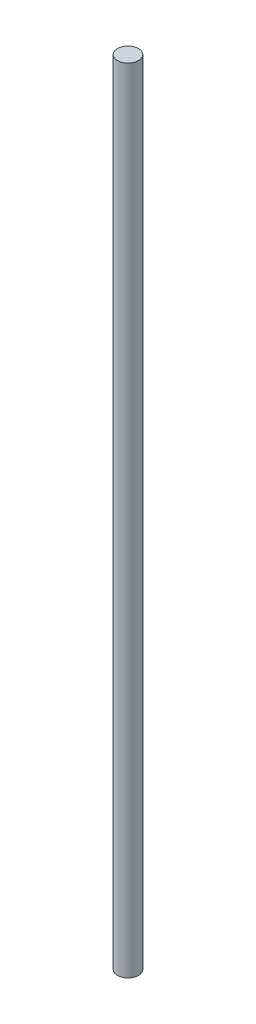
ISO-10303-21;
HEADER;
FILE_DESCRIPTION(('STEP AP214'),'2;1');
FILE_NAME('part.step','',(''),(''),'','','');
FILE_SCHEMA(('AUTOMOTIVE_DESIGN { 1 0 10303 214 1 1 1 1 }'));
ENDSEC;
DATA;
#1=APPLICATION_CONTEXT('core data for automotive mechanical design processes');
#2=APPLICATION_PROTOCOL_DEFINITION('international standard','automotive_design',2000,#1);
#3=PRODUCT_CONTEXT('',#1,'mechanical');
#4=PRODUCT('Part','Part','',(#3));
#5=PRODUCT_RELATED_PRODUCT_CATEGORY('part','',(#4));
#6=PRODUCT_DEFINITION_FORMATION('','',#4);
#7=PRODUCT_DEFINITION_CONTEXT('part definition',#1,'design');
#8=PRODUCT_DEFINITION('design','',#6,#7);
#9=PRODUCT_DEFINITION_SHAPE('','',#8);
#10=(LENGTH_UNIT() NAMED_UNIT(*) SI_UNIT(.MILLI.,.METRE.));
#11=(NAMED_UNIT(*) PLANE_ANGLE_UNIT() SI_UNIT($,.RADIAN.));
#12=(NAMED_UNIT(*) SI_UNIT($,.STERADIAN.) SOLID_ANGLE_UNIT());
#13=UNCERTAINTY_MEASURE_WITH_UNIT(LENGTH_MEASURE(1.E-05),#10,'distance_accuracy_value','');
#14=(GEOMETRIC_REPRESENTATION_CONTEXT(3) GLOBAL_UNCERTAINTY_ASSIGNED_CONTEXT((#13)) GLOBAL_UNIT_ASSIGNED_CONTEXT((#10,
#11,#12)) REPRESENTATION_CONTEXT('',''));
#15=CARTESIAN_POINT('',(0.,0.,0.));
#16=DIRECTION('',(0.,0.,1.));
#17=DIRECTION('',(1.,0.,0.));
#18=AXIS2_PLACEMENT_3D('',#15,#16,#17);
#19=CARTESIAN_POINT('',(0.,480.,0.));
#20=DIRECTION('',(0.,-1.,0.));
#21=DIRECTION('',(0.,0.,-1.));
#22=AXIS2_PLACEMENT_3D('',#19,#20,#21);
#23=CYLINDRICAL_SURFACE('',#22,6.35);
#24=CARTESIAN_POINT('',(0.,480.,0.));
#25=DIRECTION('',(0.,1.,0.));
#26=DIRECTION('',(0.,0.,1.));
#27=AXIS2_PLACEMENT_3D('',#24,#25,#26);
#28=CIRCLE('',#27,6.35);
#29=CARTESIAN_POINT('',(0.,480.,6.35));
#30=VERTEX_POINT('',#29);
#31=EDGE_CURVE('E10',#30,#30,#28,.T.);
#32=ORIENTED_EDGE('',*,*,#31,.F.);
#33=EDGE_LOOP('',(#32));
#34=FACE_BOUND('',#33,.T.);
#35=CARTESIAN_POINT('',(0.,0.,0.));
#36=DIRECTION('',(0.,1.,0.));
#37=DIRECTION('',(0.,0.,1.));
#38=AXIS2_PLACEMENT_3D('',#35,#36,#37);
#39=CIRCLE('',#38,6.35);
#40=CARTESIAN_POINT('',(0.,0.,6.35));
#41=VERTEX_POINT('',#40);
#42=EDGE_CURVE('E34',#41,#41,#39,.T.);
#43=ORIENTED_EDGE('',*,*,#42,.T.);
#44=EDGE_LOOP('',(#43));
#45=FACE_BOUND('',#44,.T.);
#46=ADVANCED_FACE('F31',(#34,#45),#23,.T.);
#47=CARTESIAN_POINT('',(0.,480.,0.));
#48=DIRECTION('',(0.,1.,0.));
#49=DIRECTION('',(0.,0.,1.));
#50=AXIS2_PLACEMENT_3D('',#47,#48,#49);
#51=PLANE('',#50);
#52=ORIENTED_EDGE('',*,*,#31,.T.);
#53=EDGE_LOOP('',(#52));
#54=FACE_BOUND('',#53,.T.);
#55=ADVANCED_FACE('F46',(#54),#51,.T.);
#56=CARTESIAN_POINT('',(0.,0.,0.));
#57=DIRECTION('',(0.,1.,0.));
#58=DIRECTION('',(0.,0.,1.));
#59=AXIS2_PLACEMENT_3D('',#56,#57,#58);
#60=PLANE('',#59);
#61=ORIENTED_EDGE('',*,*,#42,.F.);
#62=EDGE_LOOP('',(#61));
#63=FACE_BOUND('',#62,.T.);
#64=ADVANCED_FACE('F44',(#63),#60,.F.);
#65=CLOSED_SHELL('',(#46,#55,#64));
#66=MANIFOLD_SOLID_BREP('B2',#65);
#67=ADVANCED_BREP_SHAPE_REPRESENTATION('',(#18,#66),#14);
#68=SHAPE_DEFINITION_REPRESENTATION(#9,#67);
ENDSEC;
END-ISO-10303-21;
